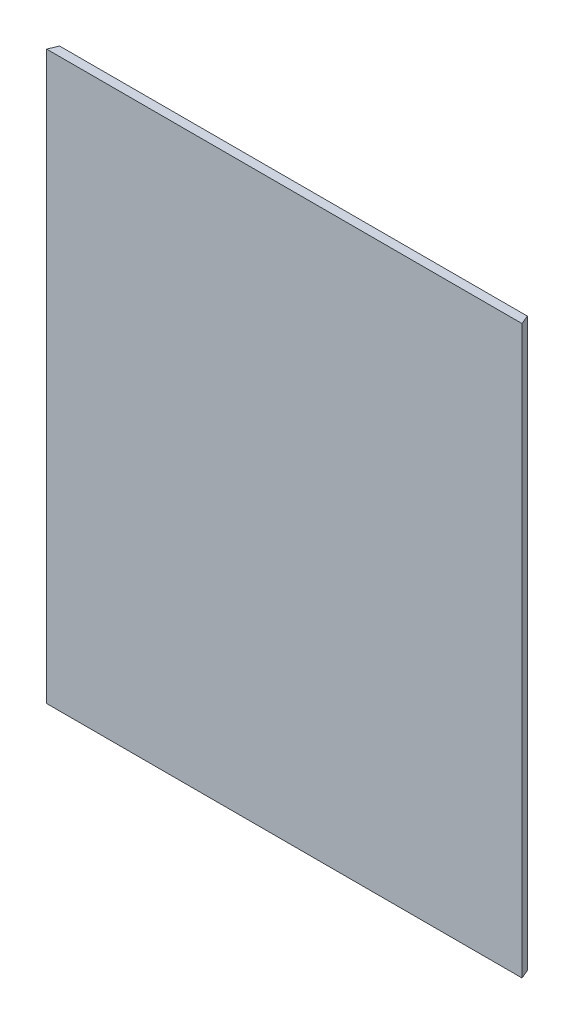
ISO-10303-21;
HEADER;
FILE_DESCRIPTION(('STEP AP214'),'2;1');
FILE_NAME('part.step','',(''),(''),'','','');
FILE_SCHEMA(('AUTOMOTIVE_DESIGN { 1 0 10303 214 1 1 1 1 }'));
ENDSEC;
DATA;
#1=APPLICATION_CONTEXT('core data for automotive mechanical design processes');
#2=APPLICATION_PROTOCOL_DEFINITION('international standard','automotive_design',2000,#1);
#3=PRODUCT_CONTEXT('',#1,'mechanical');
#4=PRODUCT('Part','Part','',(#3));
#5=PRODUCT_RELATED_PRODUCT_CATEGORY('part','',(#4));
#6=PRODUCT_DEFINITION_FORMATION('','',#4);
#7=PRODUCT_DEFINITION_CONTEXT('part definition',#1,'design');
#8=PRODUCT_DEFINITION('design','',#6,#7);
#9=PRODUCT_DEFINITION_SHAPE('','',#8);
#10=(LENGTH_UNIT() NAMED_UNIT(*) SI_UNIT(.MILLI.,.METRE.));
#11=(NAMED_UNIT(*) PLANE_ANGLE_UNIT() SI_UNIT($,.RADIAN.));
#12=(NAMED_UNIT(*) SI_UNIT($,.STERADIAN.) SOLID_ANGLE_UNIT());
#13=UNCERTAINTY_MEASURE_WITH_UNIT(LENGTH_MEASURE(1.E-05),#10,'distance_accuracy_value','');
#14=(GEOMETRIC_REPRESENTATION_CONTEXT(3) GLOBAL_UNCERTAINTY_ASSIGNED_CONTEXT((#13)) GLOBAL_UNIT_ASSIGNED_CONTEXT((#10,
#11,#12)) REPRESENTATION_CONTEXT('',''));
#15=CARTESIAN_POINT('',(0.,0.,0.));
#16=DIRECTION('',(0.,0.,1.));
#17=DIRECTION('',(1.,0.,0.));
#18=AXIS2_PLACEMENT_3D('',#15,#16,#17);
#19=CARTESIAN_POINT('',(0.,0.,5.));
#20=DIRECTION('',(0.,1.,0.));
#21=DIRECTION('',(0.,0.,1.));
#22=AXIS2_PLACEMENT_3D('',#19,#20,#21);
#23=PLANE('',#22);
#24=DIRECTION('',(1.,0.,0.));
#25=VECTOR('',#24,1.);
#26=CARTESIAN_POINT('',(0.,0.,0.));
#27=LINE('',#26,#25);
#28=CARTESIAN_POINT('',(0.,0.,0.));
#29=VERTEX_POINT('',#28);
#30=CARTESIAN_POINT('',(255.86,0.,0.));
#31=VERTEX_POINT('',#30);
#32=EDGE_CURVE('E56',#29,#31,#27,.T.);
#33=ORIENTED_EDGE('',*,*,#32,.T.);
#34=DIRECTION('',(-0.382515002167418,0.,-0.92394928059762));
#35=VECTOR('',#34,1.);
#36=CARTESIAN_POINT('',(255.86,0.,0.));
#37=LINE('',#36,#35);
#38=CARTESIAN_POINT('',(257.93,0.,5.));
#39=VERTEX_POINT('',#38);
#40=EDGE_CURVE('E76',#39,#31,#37,.T.);
#41=ORIENTED_EDGE('',*,*,#40,.F.);
#42=DIRECTION('',(1.,0.,0.));
#43=VECTOR('',#42,1.);
#44=CARTESIAN_POINT('',(0.,0.,5.));
#45=LINE('',#44,#43);
#46=CARTESIAN_POINT('',(-2.07000000000002,0.,5.));
#47=VERTEX_POINT('',#46);
#48=EDGE_CURVE('E41',#47,#39,#45,.T.);
#49=ORIENTED_EDGE('',*,*,#48,.F.);
#50=DIRECTION('',(-0.382515002167418,0.,0.92394928059762));
#51=VECTOR('',#50,1.);
#52=CARTESIAN_POINT('',(0.,0.,0.));
#53=LINE('',#52,#51);
#54=EDGE_CURVE('E74',#29,#47,#53,.T.);
#55=ORIENTED_EDGE('',*,*,#54,.F.);
#56=EDGE_LOOP('',(#33,#41,#49,#55));
#57=FACE_BOUND('',#56,.T.);
#58=ADVANCED_FACE('F33',(#57),#23,.F.);
#59=CARTESIAN_POINT('',(0.,310.,5.));
#60=DIRECTION('',(0.,-1.,0.));
#61=DIRECTION('',(0.,0.,-1.));
#62=AXIS2_PLACEMENT_3D('',#59,#60,#61);
#63=PLANE('',#62);
#64=DIRECTION('',(-1.,0.,0.));
#65=VECTOR('',#64,1.);
#66=CARTESIAN_POINT('',(0.,310.,0.));
#67=LINE('',#66,#65);
#68=CARTESIAN_POINT('',(255.86,310.,0.));
#69=VERTEX_POINT('',#68);
#70=CARTESIAN_POINT('',(0.,310.,0.));
#71=VERTEX_POINT('',#70);
#72=EDGE_CURVE('E36',#69,#71,#67,.T.);
#73=ORIENTED_EDGE('',*,*,#72,.T.);
#74=DIRECTION('',(-0.382515002167418,0.,0.92394928059762));
#75=VECTOR('',#74,1.);
#76=CARTESIAN_POINT('',(0.,310.,0.));
#77=LINE('',#76,#75);
#78=CARTESIAN_POINT('',(-2.07000000000002,310.,5.));
#79=VERTEX_POINT('',#78);
#80=EDGE_CURVE('E94',#71,#79,#77,.T.);
#81=ORIENTED_EDGE('',*,*,#80,.T.);
#82=DIRECTION('',(-1.,0.,0.));
#83=VECTOR('',#82,1.);
#84=CARTESIAN_POINT('',(0.,310.,5.));
#85=LINE('',#84,#83);
#86=CARTESIAN_POINT('',(257.93,310.,5.));
#87=VERTEX_POINT('',#86);
#88=EDGE_CURVE('E11',#87,#79,#85,.T.);
#89=ORIENTED_EDGE('',*,*,#88,.F.);
#90=DIRECTION('',(-0.382515002167418,0.,-0.92394928059762));
#91=VECTOR('',#90,1.);
#92=CARTESIAN_POINT('',(255.86,310.,0.));
#93=LINE('',#92,#91);
#94=EDGE_CURVE('E91',#87,#69,#93,.T.);
#95=ORIENTED_EDGE('',*,*,#94,.T.);
#96=EDGE_LOOP('',(#73,#81,#89,#95));
#97=FACE_BOUND('',#96,.T.);
#98=ADVANCED_FACE('F106',(#97),#63,.F.);
#99=CARTESIAN_POINT('',(0.,0.,5.));
#100=DIRECTION('',(0.,0.,-1.));
#101=DIRECTION('',(-1.,0.,0.));
#102=AXIS2_PLACEMENT_3D('',#99,#100,#101);
#103=PLANE('',#102);
#104=ORIENTED_EDGE('',*,*,#88,.T.);
#105=DIRECTION('',(0.,1.,0.));
#106=VECTOR('',#105,1.);
#107=CARTESIAN_POINT('',(-2.07000000000002,0.,5.));
#108=LINE('',#107,#106);
#109=EDGE_CURVE('E82',#47,#79,#108,.T.);
#110=ORIENTED_EDGE('',*,*,#109,.F.);
#111=ORIENTED_EDGE('',*,*,#48,.T.);
#112=DIRECTION('',(0.,1.,0.));
#113=VECTOR('',#112,1.);
#114=CARTESIAN_POINT('',(257.93,0.,5.));
#115=LINE('',#114,#113);
#116=EDGE_CURVE('E86',#39,#87,#115,.T.);
#117=ORIENTED_EDGE('',*,*,#116,.T.);
#118=EDGE_LOOP('',(#104,#110,#111,#117));
#119=FACE_BOUND('',#118,.T.);
#120=ADVANCED_FACE('F83',(#119),#103,.F.);
#121=CARTESIAN_POINT('',(0.,0.,0.));
#122=DIRECTION('',(0.,0.,-1.));
#123=DIRECTION('',(-1.,0.,0.));
#124=AXIS2_PLACEMENT_3D('',#121,#122,#123);
#125=PLANE('',#124);
#126=DIRECTION('',(0.,-1.,0.));
#127=VECTOR('',#126,1.);
#128=CARTESIAN_POINT('',(0.,0.,0.));
#129=LINE('',#128,#127);
#130=EDGE_CURVE('E90',#71,#29,#129,.T.);
#131=ORIENTED_EDGE('',*,*,#130,.F.);
#132=ORIENTED_EDGE('',*,*,#72,.F.);
#133=DIRECTION('',(0.,1.,0.));
#134=VECTOR('',#133,1.);
#135=CARTESIAN_POINT('',(255.86,0.,0.));
#136=LINE('',#135,#134);
#137=EDGE_CURVE('E100',#31,#69,#136,.T.);
#138=ORIENTED_EDGE('',*,*,#137,.F.);
#139=ORIENTED_EDGE('',*,*,#32,.F.);
#140=EDGE_LOOP('',(#131,#132,#138,#139));
#141=FACE_BOUND('',#140,.T.);
#142=ADVANCED_FACE('F112',(#141),#125,.T.);
#143=CARTESIAN_POINT('',(255.86,0.,0.));
#144=DIRECTION('',(0.92394928059762,0.,-0.382515002167418));
#145=DIRECTION('',(-0.382515002167418,0.,-0.92394928059762));
#146=AXIS2_PLACEMENT_3D('',#143,#144,#145);
#147=PLANE('',#146);
#148=ORIENTED_EDGE('',*,*,#94,.F.);
#149=ORIENTED_EDGE('',*,*,#116,.F.);
#150=ORIENTED_EDGE('',*,*,#40,.T.);
#151=ORIENTED_EDGE('',*,*,#137,.T.);
#152=EDGE_LOOP('',(#148,#149,#150,#151));
#153=FACE_BOUND('',#152,.T.);
#154=ADVANCED_FACE('F104',(#153),#147,.T.);
#155=CARTESIAN_POINT('',(0.,0.,0.));
#156=DIRECTION('',(-0.92394928059762,0.,-0.382515002167418));
#157=DIRECTION('',(-0.382515002167418,0.,0.92394928059762));
#158=AXIS2_PLACEMENT_3D('',#155,#156,#157);
#159=PLANE('',#158);
#160=ORIENTED_EDGE('',*,*,#80,.F.);
#161=ORIENTED_EDGE('',*,*,#130,.T.);
#162=ORIENTED_EDGE('',*,*,#54,.T.);
#163=ORIENTED_EDGE('',*,*,#109,.T.);
#164=EDGE_LOOP('',(#160,#161,#162,#163));
#165=FACE_BOUND('',#164,.T.);
#166=ADVANCED_FACE('F89',(#165),#159,.T.);
#167=CLOSED_SHELL('',(#58,#98,#120,#142,#154,#166));
#168=MANIFOLD_SOLID_BREP('B2',#167);
#169=ADVANCED_BREP_SHAPE_REPRESENTATION('',(#18,#168),#14);
#170=SHAPE_DEFINITION_REPRESENTATION(#9,#169);
ENDSEC;
END-ISO-10303-21;
